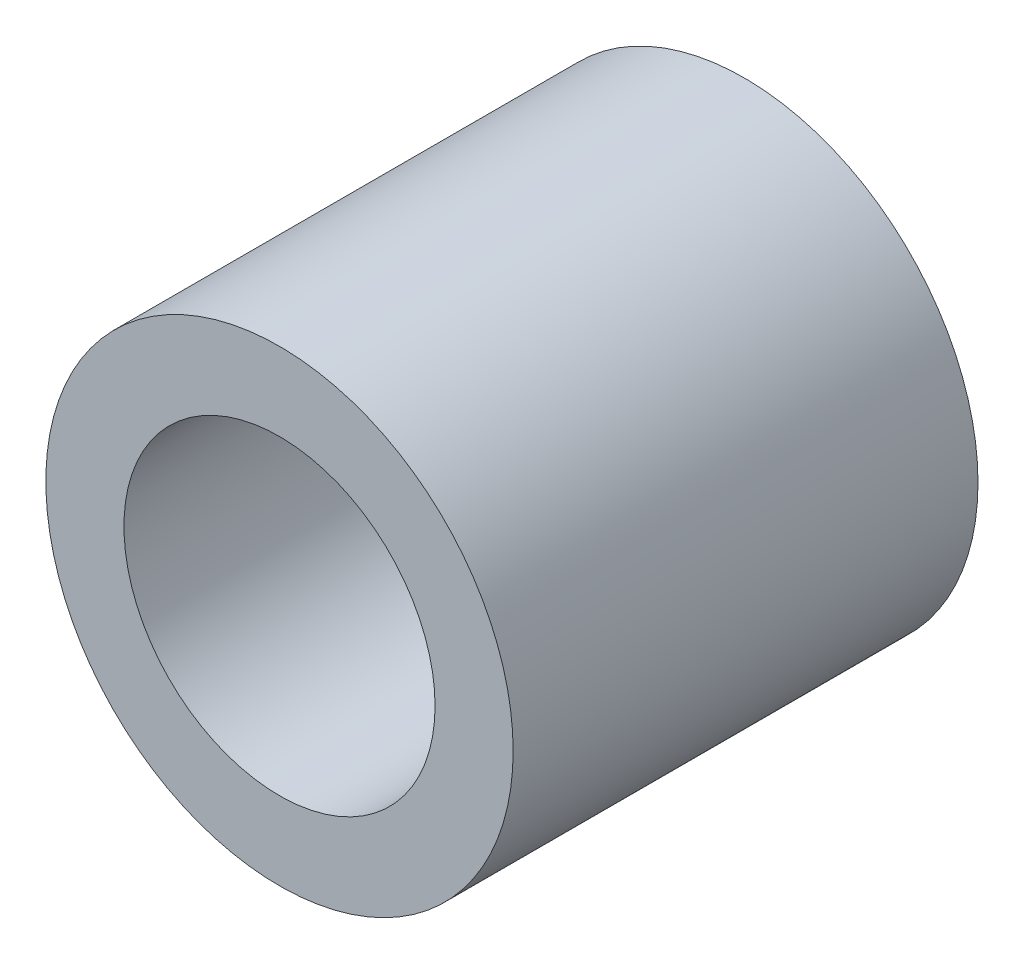
ISO-10303-21;
HEADER;
FILE_DESCRIPTION(('STEP AP214'),'2;1');
FILE_NAME('part.step','',(''),(''),'','','');
FILE_SCHEMA(('AUTOMOTIVE_DESIGN { 1 0 10303 214 1 1 1 1 }'));
ENDSEC;
DATA;
#1=APPLICATION_CONTEXT('core data for automotive mechanical design processes');
#2=APPLICATION_PROTOCOL_DEFINITION('international standard','automotive_design',2000,#1);
#3=PRODUCT_CONTEXT('',#1,'mechanical');
#4=PRODUCT('Part','Part','',(#3));
#5=PRODUCT_RELATED_PRODUCT_CATEGORY('part','',(#4));
#6=PRODUCT_DEFINITION_FORMATION('','',#4);
#7=PRODUCT_DEFINITION_CONTEXT('part definition',#1,'design');
#8=PRODUCT_DEFINITION('design','',#6,#7);
#9=PRODUCT_DEFINITION_SHAPE('','',#8);
#10=(LENGTH_UNIT() NAMED_UNIT(*) SI_UNIT(.MILLI.,.METRE.));
#11=(NAMED_UNIT(*) PLANE_ANGLE_UNIT() SI_UNIT($,.RADIAN.));
#12=(NAMED_UNIT(*) SI_UNIT($,.STERADIAN.) SOLID_ANGLE_UNIT());
#13=UNCERTAINTY_MEASURE_WITH_UNIT(LENGTH_MEASURE(1.E-05),#10,'distance_accuracy_value','');
#14=(GEOMETRIC_REPRESENTATION_CONTEXT(3) GLOBAL_UNCERTAINTY_ASSIGNED_CONTEXT((#13)) GLOBAL_UNIT_ASSIGNED_CONTEXT((#10,
#11,#12)) REPRESENTATION_CONTEXT('',''));
#15=CARTESIAN_POINT('',(0.,0.,0.));
#16=DIRECTION('',(0.,0.,1.));
#17=DIRECTION('',(1.,0.,0.));
#18=AXIS2_PLACEMENT_3D('',#15,#16,#17);
#19=CARTESIAN_POINT('',(0.,0.,4.7625));
#20=DIRECTION('',(0.,0.,1.));
#21=DIRECTION('',(1.,0.,0.));
#22=AXIS2_PLACEMENT_3D('',#19,#20,#21);
#23=PLANE('',#22);
#24=CARTESIAN_POINT('',(0.,0.,4.7625));
#25=DIRECTION('',(0.,0.,1.));
#26=DIRECTION('',(1.,0.,0.));
#27=AXIS2_PLACEMENT_3D('',#24,#25,#26);
#28=CIRCLE('',#27,4.7879);
#29=CARTESIAN_POINT('',(4.7879,0.,4.7625));
#30=VERTEX_POINT('',#29);
#31=EDGE_CURVE('E10',#30,#30,#28,.T.);
#32=ORIENTED_EDGE('',*,*,#31,.T.);
#33=EDGE_LOOP('',(#32));
#34=FACE_BOUND('',#33,.T.);
#35=CARTESIAN_POINT('',(0.,0.,4.7625));
#36=DIRECTION('',(0.,0.,1.));
#37=DIRECTION('',(1.,0.,0.));
#38=AXIS2_PLACEMENT_3D('',#35,#36,#37);
#39=CIRCLE('',#38,3.1877);
#40=CARTESIAN_POINT('',(3.1877,0.,4.7625));
#41=VERTEX_POINT('',#40);
#42=EDGE_CURVE('E42',#41,#41,#39,.T.);
#43=ORIENTED_EDGE('',*,*,#42,.F.);
#44=EDGE_LOOP('',(#43));
#45=FACE_BOUND('',#44,.T.);
#46=ADVANCED_FACE('F31',(#34,#45),#23,.T.);
#47=CARTESIAN_POINT('',(0.,0.,-4.7625));
#48=DIRECTION('',(0.,0.,1.));
#49=DIRECTION('',(1.,0.,0.));
#50=AXIS2_PLACEMENT_3D('',#47,#48,#49);
#51=PLANE('',#50);
#52=CARTESIAN_POINT('',(0.,0.,-4.7625));
#53=DIRECTION('',(0.,0.,1.));
#54=DIRECTION('',(1.,0.,0.));
#55=AXIS2_PLACEMENT_3D('',#52,#53,#54);
#56=CIRCLE('',#55,4.7879);
#57=CARTESIAN_POINT('',(4.7879,0.,-4.7625));
#58=VERTEX_POINT('',#57);
#59=EDGE_CURVE('E35',#58,#58,#56,.T.);
#60=ORIENTED_EDGE('',*,*,#59,.F.);
#61=EDGE_LOOP('',(#60));
#62=FACE_BOUND('',#61,.T.);
#63=CARTESIAN_POINT('',(0.,0.,-4.7625));
#64=DIRECTION('',(0.,0.,1.));
#65=DIRECTION('',(1.,0.,0.));
#66=AXIS2_PLACEMENT_3D('',#63,#64,#65);
#67=CIRCLE('',#66,3.1877);
#68=CARTESIAN_POINT('',(3.1877,0.,-4.7625));
#69=VERTEX_POINT('',#68);
#70=EDGE_CURVE('E44',#69,#69,#67,.T.);
#71=ORIENTED_EDGE('',*,*,#70,.T.);
#72=EDGE_LOOP('',(#71));
#73=FACE_BOUND('',#72,.T.);
#74=ADVANCED_FACE('F54',(#62,#73),#51,.F.);
#75=CARTESIAN_POINT('',(0.,0.,4.7625));
#76=DIRECTION('',(0.,0.,-1.));
#77=DIRECTION('',(-1.,0.,0.));
#78=AXIS2_PLACEMENT_3D('',#75,#76,#77);
#79=CYLINDRICAL_SURFACE('',#78,4.7879);
#80=ORIENTED_EDGE('',*,*,#31,.F.);
#81=EDGE_LOOP('',(#80));
#82=FACE_BOUND('',#81,.T.);
#83=ORIENTED_EDGE('',*,*,#59,.T.);
#84=EDGE_LOOP('',(#83));
#85=FACE_BOUND('',#84,.T.);
#86=ADVANCED_FACE('F33',(#82,#85),#79,.T.);
#87=CARTESIAN_POINT('',(0.,0.,4.7625));
#88=DIRECTION('',(0.,0.,-1.));
#89=DIRECTION('',(-1.,0.,0.));
#90=AXIS2_PLACEMENT_3D('',#87,#88,#89);
#91=CYLINDRICAL_SURFACE('',#90,3.1877);
#92=ORIENTED_EDGE('',*,*,#42,.T.);
#93=EDGE_LOOP('',(#92));
#94=FACE_BOUND('',#93,.T.);
#95=ORIENTED_EDGE('',*,*,#70,.F.);
#96=EDGE_LOOP('',(#95));
#97=FACE_BOUND('',#96,.T.);
#98=ADVANCED_FACE('F50',(#94,#97),#91,.F.);
#99=CLOSED_SHELL('',(#46,#74,#86,#98));
#100=MANIFOLD_SOLID_BREP('B2',#99);
#101=ADVANCED_BREP_SHAPE_REPRESENTATION('',(#18,#100),#14);
#102=SHAPE_DEFINITION_REPRESENTATION(#9,#101);
ENDSEC;
END-ISO-10303-21;
